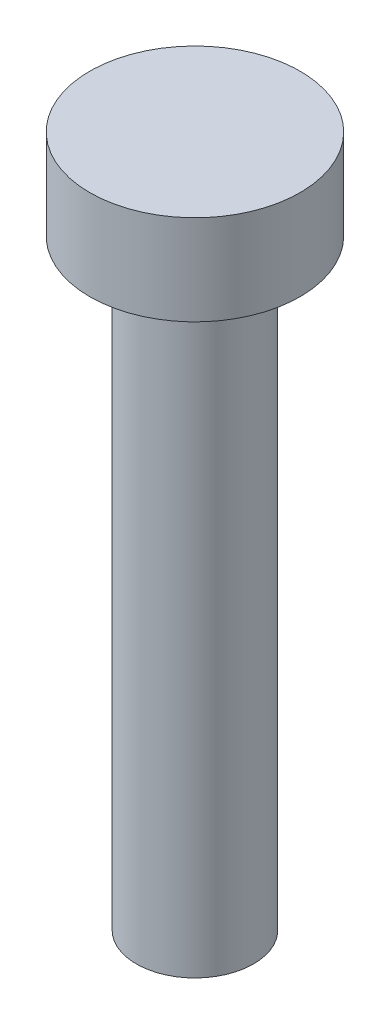
ISO-10303-21;
HEADER;
FILE_DESCRIPTION(('STEP AP214'),'2;1');
FILE_NAME('part.step','',(''),(''),'','','');
FILE_SCHEMA(('AUTOMOTIVE_DESIGN { 1 0 10303 214 1 1 1 1 }'));
ENDSEC;
DATA;
#1=APPLICATION_CONTEXT('core data for automotive mechanical design processes');
#2=APPLICATION_PROTOCOL_DEFINITION('international standard','automotive_design',2000,#1);
#3=PRODUCT_CONTEXT('',#1,'mechanical');
#4=PRODUCT('Part','Part','',(#3));
#5=PRODUCT_RELATED_PRODUCT_CATEGORY('part','',(#4));
#6=PRODUCT_DEFINITION_FORMATION('','',#4);
#7=PRODUCT_DEFINITION_CONTEXT('part definition',#1,'design');
#8=PRODUCT_DEFINITION('design','',#6,#7);
#9=PRODUCT_DEFINITION_SHAPE('','',#8);
#10=(LENGTH_UNIT() NAMED_UNIT(*) SI_UNIT(.MILLI.,.METRE.));
#11=(NAMED_UNIT(*) PLANE_ANGLE_UNIT() SI_UNIT($,.RADIAN.));
#12=(NAMED_UNIT(*) SI_UNIT($,.STERADIAN.) SOLID_ANGLE_UNIT());
#13=UNCERTAINTY_MEASURE_WITH_UNIT(LENGTH_MEASURE(1.E-05),#10,'distance_accuracy_value','');
#14=(GEOMETRIC_REPRESENTATION_CONTEXT(3) GLOBAL_UNCERTAINTY_ASSIGNED_CONTEXT((#13)) GLOBAL_UNIT_ASSIGNED_CONTEXT((#10,
#11,#12)) REPRESENTATION_CONTEXT('',''));
#15=CARTESIAN_POINT('',(0.,0.,0.));
#16=DIRECTION('',(0.,0.,1.));
#17=DIRECTION('',(1.,0.,0.));
#18=AXIS2_PLACEMENT_3D('',#15,#16,#17);
#19=CARTESIAN_POINT('',(0.,3.,0.));
#20=DIRECTION('',(0.,-1.,0.));
#21=DIRECTION('',(0.,0.,-1.));
#22=AXIS2_PLACEMENT_3D('',#19,#20,#21);
#23=CYLINDRICAL_SURFACE('',#22,3.5);
#24=CARTESIAN_POINT('',(0.,3.,0.));
#25=DIRECTION('',(0.,1.,0.));
#26=DIRECTION('',(0.,0.,1.));
#27=AXIS2_PLACEMENT_3D('',#24,#25,#26);
#28=CIRCLE('',#27,3.5);
#29=CARTESIAN_POINT('',(0.,3.,3.5));
#30=VERTEX_POINT('',#29);
#31=EDGE_CURVE('E39',#30,#30,#28,.T.);
#32=ORIENTED_EDGE('',*,*,#31,.F.);
#33=EDGE_LOOP('',(#32));
#34=FACE_BOUND('',#33,.T.);
#35=CARTESIAN_POINT('',(0.,0.,0.));
#36=DIRECTION('',(0.,1.,0.));
#37=DIRECTION('',(0.,0.,1.));
#38=AXIS2_PLACEMENT_3D('',#35,#36,#37);
#39=CIRCLE('',#38,3.5);
#40=CARTESIAN_POINT('',(0.,0.,3.5));
#41=VERTEX_POINT('',#40);
#42=EDGE_CURVE('E35',#41,#41,#39,.T.);
#43=ORIENTED_EDGE('',*,*,#42,.T.);
#44=EDGE_LOOP('',(#43));
#45=FACE_BOUND('',#44,.T.);
#46=ADVANCED_FACE('F32',(#34,#45),#23,.T.);
#47=CARTESIAN_POINT('',(0.,3.,0.));
#48=DIRECTION('',(0.,1.,0.));
#49=DIRECTION('',(0.,0.,1.));
#50=AXIS2_PLACEMENT_3D('',#47,#48,#49);
#51=PLANE('',#50);
#52=ORIENTED_EDGE('',*,*,#31,.T.);
#53=EDGE_LOOP('',(#52));
#54=FACE_BOUND('',#53,.T.);
#55=ADVANCED_FACE('F56',(#54),#51,.T.);
#56=CARTESIAN_POINT('',(0.,0.,0.));
#57=DIRECTION('',(0.,1.,0.));
#58=DIRECTION('',(0.,0.,1.));
#59=AXIS2_PLACEMENT_3D('',#56,#57,#58);
#60=PLANE('',#59);
#61=CARTESIAN_POINT('',(0.,0.,0.));
#62=DIRECTION('',(0.,-1.,0.));
#63=DIRECTION('',(0.,0.,-1.));
#64=AXIS2_PLACEMENT_3D('',#61,#62,#63);
#65=CIRCLE('',#64,1.95);
#66=CARTESIAN_POINT('',(0.,0.,-1.95));
#67=VERTEX_POINT('',#66);
#68=EDGE_CURVE('E10',#67,#67,#65,.T.);
#69=ORIENTED_EDGE('',*,*,#68,.F.);
#70=EDGE_LOOP('',(#69));
#71=FACE_BOUND('',#70,.T.);
#72=ORIENTED_EDGE('',*,*,#42,.F.);
#73=EDGE_LOOP('',(#72));
#74=FACE_BOUND('',#73,.T.);
#75=ADVANCED_FACE('F53',(#71,#74),#60,.F.);
#76=CARTESIAN_POINT('',(0.,-20.,0.));
#77=DIRECTION('',(0.,1.,0.));
#78=DIRECTION('',(0.,0.,1.));
#79=AXIS2_PLACEMENT_3D('',#76,#77,#78);
#80=CYLINDRICAL_SURFACE('',#79,1.95);
#81=CARTESIAN_POINT('',(0.,-20.,0.));
#82=DIRECTION('',(0.,-1.,0.));
#83=DIRECTION('',(0.,0.,-1.));
#84=AXIS2_PLACEMENT_3D('',#81,#82,#83);
#85=CIRCLE('',#84,1.95);
#86=CARTESIAN_POINT('',(0.,-20.,-1.95));
#87=VERTEX_POINT('',#86);
#88=EDGE_CURVE('E45',#87,#87,#85,.T.);
#89=ORIENTED_EDGE('',*,*,#88,.F.);
#90=EDGE_LOOP('',(#89));
#91=FACE_BOUND('',#90,.T.);
#92=ORIENTED_EDGE('',*,*,#68,.T.);
#93=EDGE_LOOP('',(#92));
#94=FACE_BOUND('',#93,.T.);
#95=ADVANCED_FACE('F55',(#91,#94),#80,.T.);
#96=CARTESIAN_POINT('',(0.,-20.,0.));
#97=DIRECTION('',(0.,-1.,0.));
#98=DIRECTION('',(0.,0.,-1.));
#99=AXIS2_PLACEMENT_3D('',#96,#97,#98);
#100=PLANE('',#99);
#101=ORIENTED_EDGE('',*,*,#88,.T.);
#102=EDGE_LOOP('',(#101));
#103=FACE_BOUND('',#102,.T.);
#104=ADVANCED_FACE('F62',(#103),#100,.T.);
#105=CLOSED_SHELL('',(#46,#55,#75,#95,#104));
#106=MANIFOLD_SOLID_BREP('B2',#105);
#107=ADVANCED_BREP_SHAPE_REPRESENTATION('',(#18,#106),#14);
#108=SHAPE_DEFINITION_REPRESENTATION(#9,#107);
ENDSEC;
END-ISO-10303-21;
